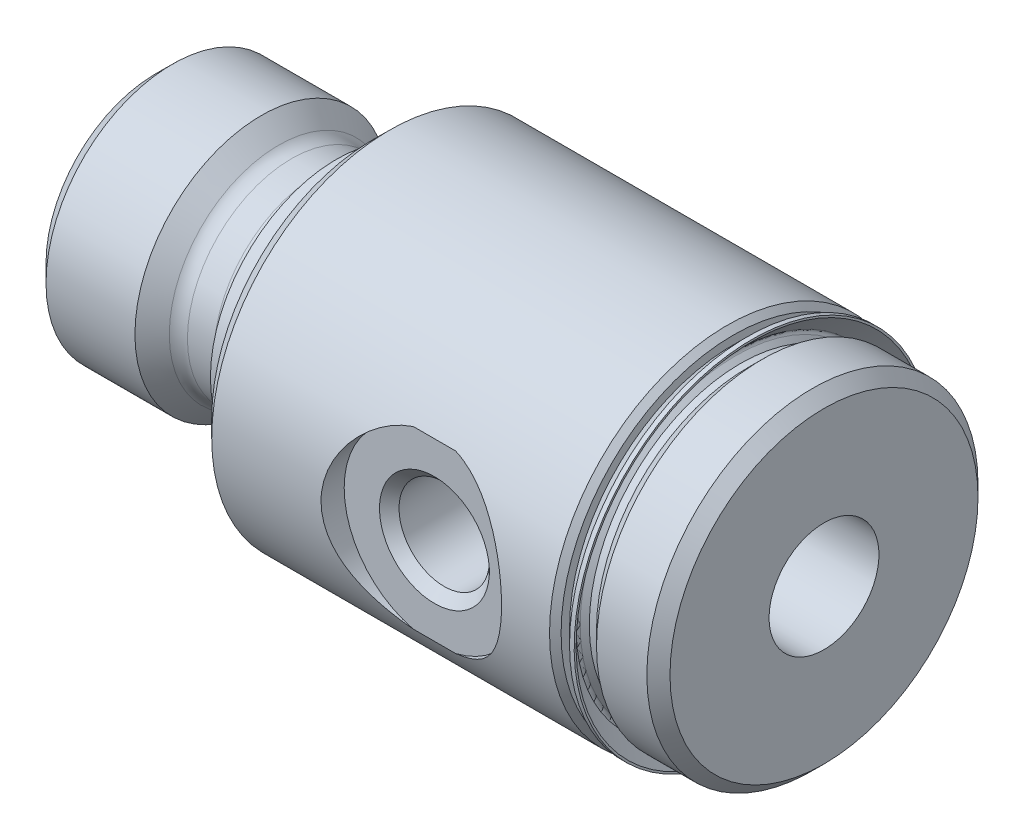
ISO-10303-21;
HEADER;
FILE_DESCRIPTION(('STEP AP214'),'2;1');
FILE_NAME('part.step','',(''),(''),'','','');
FILE_SCHEMA(('AUTOMOTIVE_DESIGN { 1 0 10303 214 1 1 1 1 }'));
ENDSEC;
DATA;
#1=APPLICATION_CONTEXT('core data for automotive mechanical design processes');
#2=APPLICATION_PROTOCOL_DEFINITION('international standard','automotive_design',2000,#1);
#3=PRODUCT_CONTEXT('',#1,'mechanical');
#4=PRODUCT('Part','Part','',(#3));
#5=PRODUCT_RELATED_PRODUCT_CATEGORY('part','',(#4));
#6=PRODUCT_DEFINITION_FORMATION('','',#4);
#7=PRODUCT_DEFINITION_CONTEXT('part definition',#1,'design');
#8=PRODUCT_DEFINITION('design','',#6,#7);
#9=PRODUCT_DEFINITION_SHAPE('','',#8);
#10=(LENGTH_UNIT() NAMED_UNIT(*) SI_UNIT(.MILLI.,.METRE.));
#11=(NAMED_UNIT(*) PLANE_ANGLE_UNIT() SI_UNIT($,.RADIAN.));
#12=(NAMED_UNIT(*) SI_UNIT($,.STERADIAN.) SOLID_ANGLE_UNIT());
#13=UNCERTAINTY_MEASURE_WITH_UNIT(LENGTH_MEASURE(1.E-05),#10,'distance_accuracy_value','');
#14=(GEOMETRIC_REPRESENTATION_CONTEXT(3) GLOBAL_UNCERTAINTY_ASSIGNED_CONTEXT((#13)) GLOBAL_UNIT_ASSIGNED_CONTEXT((#10,
#11,#12)) REPRESENTATION_CONTEXT('',''));
#15=CARTESIAN_POINT('',(0.,0.,0.));
#16=DIRECTION('',(0.,0.,1.));
#17=DIRECTION('',(1.,0.,0.));
#18=AXIS2_PLACEMENT_3D('',#15,#16,#17);
#19=CARTESIAN_POINT('',(25.3746,7.5565,0.));
#20=DIRECTION('',(-1.,0.,0.));
#21=DIRECTION('',(0.,0.,1.));
#22=AXIS2_PLACEMENT_3D('',#19,#20,#21);
#23=PLANE('',#22);
#24=CARTESIAN_POINT('',(25.3746,0.,0.));
#25=DIRECTION('',(-1.,0.,0.));
#26=DIRECTION('',(0.,0.,1.));
#27=AXIS2_PLACEMENT_3D('',#24,#25,#26);
#28=CIRCLE('',#27,7.5565);
#29=CARTESIAN_POINT('',(25.3746,0.,7.5565));
#30=VERTEX_POINT('',#29);
#31=EDGE_CURVE('E187',#30,#30,#28,.T.);
#32=ORIENTED_EDGE('',*,*,#31,.F.);
#33=EDGE_LOOP('',(#32));
#34=FACE_BOUND('',#33,.T.);
#35=CARTESIAN_POINT('',(25.3746,-4.62285431126814E-13,1.16560763103145E-13));
#36=DIRECTION('',(-1.,0.,0.));
#37=DIRECTION('',(0.,0.,1.));
#38=AXIS2_PLACEMENT_3D('',#35,#36,#37);
#39=CIRCLE('',#38,7.18614380798168);
#40=CARTESIAN_POINT('',(25.3746,-4.62285431126814E-13,7.1861438079818));
#41=VERTEX_POINT('',#40);
#42=EDGE_CURVE('E11',#41,#41,#39,.F.);
#43=ORIENTED_EDGE('',*,*,#42,.F.);
#44=EDGE_LOOP('',(#43));
#45=FACE_BOUND('',#44,.T.);
#46=ADVANCED_FACE('F38',(#34,#45),#23,.F.);
#47=CARTESIAN_POINT('',(29.3624,0.,0.));
#48=DIRECTION('',(-1.,0.,0.));
#49=DIRECTION('',(0.,0.,1.));
#50=AXIS2_PLACEMENT_3D('',#47,#48,#49);
#51=CYLINDRICAL_SURFACE('',#50,6.63575);
#52=CARTESIAN_POINT('',(26.0096,0.,0.));
#53=DIRECTION('',(-1.,0.,0.));
#54=DIRECTION('',(0.,0.,1.));
#55=AXIS2_PLACEMENT_3D('',#52,#53,#54);
#56=CIRCLE('',#55,6.63575);
#57=CARTESIAN_POINT('',(26.0096,0.,6.63575));
#58=VERTEX_POINT('',#57);
#59=EDGE_CURVE('E179',#58,#58,#56,.T.);
#60=ORIENTED_EDGE('',*,*,#59,.T.);
#61=EDGE_LOOP('',(#60));
#62=FACE_BOUND('',#61,.T.);
#63=CARTESIAN_POINT('',(25.6921000000003,-4.56834570172766E-13,0.));
#64=DIRECTION('',(-1.,0.,0.));
#65=DIRECTION('',(0.,-1.,0.));
#66=AXIS2_PLACEMENT_3D('',#63,#64,#65);
#67=CIRCLE('',#66,6.63575);
#68=CARTESIAN_POINT('',(25.6921000000002,-6.63575000000046,0.));
#69=VERTEX_POINT('',#68);
#70=EDGE_CURVE('E46',#69,#69,#67,.T.);
#71=ORIENTED_EDGE('',*,*,#70,.F.);
#72=EDGE_LOOP('',(#71));
#73=FACE_BOUND('',#72,.T.);
#74=ADVANCED_FACE('F93',(#62,#73),#51,.T.);
#75=CARTESIAN_POINT('',(29.3624,0.,0.));
#76=DIRECTION('',(-1.,0.,0.));
#77=DIRECTION('',(0.,0.,1.));
#78=AXIS2_PLACEMENT_3D('',#75,#76,#77);
#79=CYLINDRICAL_SURFACE('',#78,7.8105);
#80=CARTESIAN_POINT('',(10.287,0.,0.));
#81=DIRECTION('',(-1.,0.,0.));
#82=DIRECTION('',(0.,0.,1.));
#83=AXIS2_PLACEMENT_3D('',#80,#81,#82);
#84=CIRCLE('',#83,7.8105);
#85=CARTESIAN_POINT('',(10.287,0.,7.8105));
#86=VERTEX_POINT('',#85);
#87=EDGE_CURVE('E193',#86,#86,#84,.T.);
#88=ORIENTED_EDGE('',*,*,#87,.F.);
#89=EDGE_LOOP('',(#88));
#90=FACE_BOUND('',#89,.T.);
#91=CARTESIAN_POINT('',(25.1206,0.,0.));
#92=DIRECTION('',(-1.,0.,0.));
#93=DIRECTION('',(0.,0.,1.));
#94=AXIS2_PLACEMENT_3D('',#91,#92,#93);
#95=CIRCLE('',#94,7.8105);
#96=CARTESIAN_POINT('',(25.1206,0.,7.8105));
#97=VERTEX_POINT('',#96);
#98=EDGE_CURVE('E190',#97,#97,#95,.T.);
#99=ORIENTED_EDGE('',*,*,#98,.T.);
#100=EDGE_LOOP('',(#99));
#101=FACE_BOUND('',#100,.T.);
#102=DIRECTION('',(-1.,0.,0.));
#103=VECTOR('',#102,1.);
#104=CARTESIAN_POINT('',(29.3624,-3.85210072557819,6.7945));
#105=LINE('',#104,#103);
#106=CARTESIAN_POINT('',(18.1215961223692,-3.85210072557819,6.7945));
#107=VERTEX_POINT('',#106);
#108=CARTESIAN_POINT('',(19.9784038776308,-3.85210072557819,6.7945));
#109=VERTEX_POINT('',#108);
#110=EDGE_CURVE('E76',#107,#109,#105,.F.);
#111=ORIENTED_EDGE('',*,*,#110,.F.);
#112=CARTESIAN_POINT('',(18.1215961223692,3.85210072557819,6.7945));
#113=CARTESIAN_POINT('',(18.0128551494508,3.82589500564141,6.80934433204708));
#114=CARTESIAN_POINT('',(17.9056209649567,3.7951750058606,6.82657399668449));
#115=CARTESIAN_POINT('',(17.6948458436702,3.72511680182272,6.86506038601814));
#116=CARTESIAN_POINT('',(17.5913019230518,3.6857857528599,6.88631376526359));
#117=CARTESIAN_POINT('',(17.2878087065809,3.55577888639685,6.9548471368729));
#118=CARTESIAN_POINT('',(17.0940755421578,3.45286266206165,7.00703729481279));
#119=CARTESIAN_POINT('',(16.7281103611202,3.21817634438967,7.11786553311781));
#120=CARTESIAN_POINT('',(16.5558202225669,3.08648703832436,7.17648533571343));
#121=CARTESIAN_POINT('',(16.2347811190607,2.79677234095305,7.29427484256322));
#122=CARTESIAN_POINT('',(16.0860629837427,2.63871300579142,7.35344516154358));
#123=CARTESIAN_POINT('',(15.8070015488362,2.28841557588025,7.47015661481015));
#124=CARTESIAN_POINT('',(15.6784285339262,2.09464302317268,7.52735477020865));
#125=CARTESIAN_POINT('',(15.4562392511672,1.68511919200369,7.62946016123117));
#126=CARTESIAN_POINT('',(15.3625889509786,1.4693895732163,7.67437935130223));
#127=CARTESIAN_POINT('',(15.222598391159,1.04670163284468,7.74267421743849));
#128=CARTESIAN_POINT('',(15.1721871592955,0.841388849692413,7.76787617373968));
#129=CARTESIAN_POINT('',(15.1046975346992,0.424044677405607,7.80178403706623));
#130=CARTESIAN_POINT('',(15.0876021327686,0.212016772858688,7.81049836168719));
#131=CARTESIAN_POINT('',(15.0875979050919,-0.208253092440595,7.81050160922981));
#132=CARTESIAN_POINT('',(15.104087593126,-0.416495444900188,7.80209711836994));
#133=CARTESIAN_POINT('',(15.1692154971974,-0.826593665158206,7.76936300856744));
#134=CARTESIAN_POINT('',(15.217861199563,-1.02844803428297,7.7450296812023));
#135=CARTESIAN_POINT('',(15.3449093253086,-1.41953626393276,7.68296480855789));
#136=CARTESIAN_POINT('',(15.4232143015947,-1.60880909321737,7.645277165452));
#137=CARTESIAN_POINT('',(15.6067613235194,-1.97130408916965,7.55993347529357));
#138=CARTESIAN_POINT('',(15.7120099406,-2.14452232613126,7.51227499691478));
#139=CARTESIAN_POINT('',(15.9538052593816,-2.48190984333818,7.40790858770927));
#140=CARTESIAN_POINT('',(16.0918793620173,-2.64486639030063,7.35082425979542));
#141=CARTESIAN_POINT('',(16.3921031272662,-2.94644852490168,7.23522519139544));
#142=CARTESIAN_POINT('',(16.5542737306898,-3.08505271842146,7.17670924409722));
#143=CARTESIAN_POINT('',(16.9000859546562,-3.3352651062674,7.06390731868926));
#144=CARTESIAN_POINT('',(17.0837507646518,-3.44684373778793,7.00962601637755));
#145=CARTESIAN_POINT('',(17.3722265046765,-3.59127493866339,6.93610629540564));
#146=CARTESIAN_POINT('',(17.470460770679,-3.63556844811676,6.91293281761722));
#147=CARTESIAN_POINT('',(17.6708258445217,-3.71619801837318,6.86992504364547));
#148=CARTESIAN_POINT('',(17.7729539079885,-3.75253956633275,6.85008844708623));
#149=CARTESIAN_POINT('',(17.9170538936038,-3.79721428881743,6.82534082601764));
#150=CARTESIAN_POINT('',(17.9576644911665,-3.80909600866532,6.81871427962771));
#151=CARTESIAN_POINT('',(18.0393123286186,-3.83156813434324,6.80611204807017));
#152=CARTESIAN_POINT('',(18.0803492748927,-3.84215937221748,6.80013594379516));
#153=CARTESIAN_POINT('',(18.1215961223692,-3.85210072557819,6.7945));
#154=B_SPLINE_CURVE_WITH_KNOTS('',3,(#112,#113,#114,#115,#116,#117,#118,#119,#120,#121,#122,
#123,#124,#125,#126,#127,#128,#129,#130,#131,#132,#133,#134,#135,#136,#137,#138,#139,#140,#141,
#142,#143,#144,#145,#146,#147,#148,#149,#150,#151,#152,#153),.UNSPECIFIED.,.F.,.F.,(4,2,2,2,2,2,
2,2,2,2,2,2,2,2,2,2,2,2,2,2,4),(0.,0.338222818675507,0.676165652849871,1.34921264078912,
2.02039363276876,2.69244533968194,3.40724108890215,4.12133843480017,4.75688409927621,
5.39210520461712,6.01604998873545,6.64014008630428,7.26219724397964,7.88440626359152,
8.54490302049853,9.20597716914358,9.86777122242373,10.1981171851282,10.5282344725933,
10.6567002766157,10.7850828084273),.UNSPECIFIED.);
#155=CARTESIAN_POINT('',(18.1215961223692,3.85210072557819,6.7945));
#156=VERTEX_POINT('',#155);
#157=EDGE_CURVE('E56',#156,#107,#154,.T.);
#158=ORIENTED_EDGE('',*,*,#157,.F.);
#159=DIRECTION('',(-1.,0.,0.));
#160=VECTOR('',#159,1.);
#161=CARTESIAN_POINT('',(29.3624,3.85210072557819,6.7945));
#162=LINE('',#161,#160);
#163=CARTESIAN_POINT('',(19.9784038776308,3.85210072557819,6.7945));
#164=VERTEX_POINT('',#163);
#165=EDGE_CURVE('E72',#164,#156,#162,.T.);
#166=ORIENTED_EDGE('',*,*,#165,.F.);
#167=CARTESIAN_POINT('',(19.9784038776308,-3.85210072557819,6.7945));
#168=CARTESIAN_POINT('',(20.0871441476983,-3.82589544686893,6.80934420874089));
#169=CARTESIAN_POINT('',(20.1943778263773,-3.79517548526654,6.82657379028904));
#170=CARTESIAN_POINT('',(20.4051519641891,-3.72511745285641,6.86505997155541));
#171=CARTESIAN_POINT('',(20.5086954076075,-3.68578653845436,6.88631322530072));
#172=CARTESIAN_POINT('',(20.8121889417393,-3.55578060620909,6.95484648081365));
#173=CARTESIAN_POINT('',(21.0059222633617,-3.45286628823123,7.00703655483552));
#174=CARTESIAN_POINT('',(21.3718946574185,-3.21817091332426,7.11786712811991));
#175=CARTESIAN_POINT('',(21.5441915172288,-3.08647022469435,7.17648944675929));
#176=CARTESIAN_POINT('',(21.8652206001147,-2.79677701729547,7.29427566912561));
#177=CARTESIAN_POINT('',(22.0139229679327,-2.63875169860475,7.35344016037897));
#178=CARTESIAN_POINT('',(22.2930004460401,-2.28839067605303,7.47015651935842));
#179=CARTESIAN_POINT('',(22.4216119254221,-2.09451336659921,7.52736735939915));
#180=CARTESIAN_POINT('',(22.5882521642072,-1.78745629875585,7.60395461709459));
#181=CARTESIAN_POINT('',(22.6394307437685,-1.68236335543616,7.62795130954219));
#182=CARTESIAN_POINT('',(22.7325253651758,-1.46741590935401,7.67219678193279));
#183=CARTESIAN_POINT('',(22.7744464910334,-1.35756405994037,7.69244761802928));
#184=CARTESIAN_POINT('',(22.8463423582829,-1.14048258055079,7.72752147938978));
#185=CARTESIAN_POINT('',(22.8768734567333,-1.03347688643544,7.7425931442856));
#186=CARTESIAN_POINT('',(22.9288925199877,-0.816827347829275,7.76843568198634));
#187=CARTESIAN_POINT('',(22.9503849783784,-0.707184842968019,7.77920869174365));
#188=CARTESIAN_POINT('',(22.9840506327867,-0.486160747751197,7.79614258259886));
#189=CARTESIAN_POINT('',(22.9962268423637,-0.374779731663954,7.80230495510138));
#190=CARTESIAN_POINT('',(23.0110970240145,-0.151228170032675,7.80983636785463));
#191=CARTESIAN_POINT('',(23.0137917464325,-0.039057687669266,7.81120578740914));
#192=CARTESIAN_POINT('',(23.0098626942883,0.174230727152877,7.80921306572696));
#193=CARTESIAN_POINT('',(23.0041134263872,0.27537023055635,7.80629495337319));
#194=CARTESIAN_POINT('',(22.9849140365282,0.476760563041044,7.79658748131316));
#195=CARTESIAN_POINT('',(22.9714614433281,0.577011096453558,7.78979687930726));
#196=CARTESIAN_POINT('',(22.9370107815293,0.775843869491242,7.77251093312911));
#197=CARTESIAN_POINT('',(22.9160156536495,0.874426743647872,7.76201703284431));
#198=CARTESIAN_POINT('',(22.866711471725,1.06932194629942,7.73757915700026));
#199=CARTESIAN_POINT('',(22.8383996096475,1.16563338753835,7.72363385694216));
#200=CARTESIAN_POINT('',(22.7429622417522,1.45000298576463,7.67711751193974));
#201=CARTESIAN_POINT('',(22.6652689288464,1.63387127553527,7.63983166466624));
#202=CARTESIAN_POINT('',(22.4844105074451,1.98613907629758,7.55592978822106));
#203=CARTESIAN_POINT('',(22.3812378745803,2.15453399761334,7.50931100368502));
#204=CARTESIAN_POINT('',(22.1415879893032,2.48767198577414,7.40597608662514));
#205=CARTESIAN_POINT('',(22.0029338281294,2.65068693044984,7.34872708336746));
#206=CARTESIAN_POINT('',(21.7014854689175,2.95225332865382,7.23286067534091));
#207=CARTESIAN_POINT('',(21.5386683630018,3.09078129100682,7.17424201698428));
#208=CARTESIAN_POINT('',(21.1919493818625,3.34037993308468,7.06148087689161));
#209=CARTESIAN_POINT('',(21.0080772310669,3.45148863901216,7.00733226609807));
#210=CARTESIAN_POINT('',(20.7193479654856,3.59519821350266,6.93407158259833));
#211=CARTESIAN_POINT('',(20.6210409964459,3.63924791955856,6.91099474451808));
#212=CARTESIAN_POINT('',(20.4205507786716,3.71938598222265,6.86819783346445));
#213=CARTESIAN_POINT('',(20.3183702846579,3.75547987671839,6.84847542773293));
#214=CARTESIAN_POINT('',(20.1756487853759,3.79936734605261,6.8241412914012));
#215=CARTESIAN_POINT('',(20.1364755120194,3.81075500048536,6.81778630014991));
#216=CARTESIAN_POINT('',(20.0577343126525,3.83232947195563,6.8056824487551));
#217=CARTESIAN_POINT('',(20.0181666526235,3.84251704581509,6.79993320684443));
#218=CARTESIAN_POINT('',(19.9784038776308,3.85210072557826,6.79450000000023));
#219=B_SPLINE_CURVE_WITH_KNOTS('',3,(#167,#168,#169,#170,#171,#172,#173,#174,#175,#176,#177,
#178,#179,#180,#181,#182,#183,#184,#185,#186,#187,#188,#189,#190,#191,#192,#193,#194,#195,#196,
#197,#198,#199,#200,#201,#202,#203,#204,#205,#206,#207,#208,#209,#210,#211,#212,#213,#214,#215,
#216,#217,#218),.UNSPECIFIED.,.F.,.F.,(4,2,2,2,2,2,2,2,2,2,2,2,2,2,2,2,2,2,2,2,2,2,2,2,2,4),(0.,
0.338221009541507,0.676161989637869,1.34921263131612,2.02040766224254,2.69244533008579,
3.40716181306005,3.76473320700903,4.12210773870362,4.45852719349783,4.7947791980813,
5.13092238801829,5.46703897572,5.77070634470169,6.07447118541031,6.37811772116265,
6.68188096457571,7.28827462636846,7.89484757855807,8.55664209811417,9.21906809364815,
9.88057017933556,10.210756651782,10.5407125568174,10.664555135566,10.7883191909823),.UNSPECIFIED.);
#220=EDGE_CURVE('E64',#109,#164,#219,.T.);
#221=ORIENTED_EDGE('',*,*,#220,.F.);
#222=EDGE_LOOP('',(#111,#158,#166,#221));
#223=FACE_BOUND('',#222,.T.);
#224=ADVANCED_FACE('F79',(#90,#101,#223),#79,.T.);
#225=CARTESIAN_POINT('',(29.3624,0.,0.));
#226=DIRECTION('',(-1.,0.,0.));
#227=DIRECTION('',(0.,0.,1.));
#228=AXIS2_PLACEMENT_3D('',#225,#226,#227);
#229=CYLINDRICAL_SURFACE('',#228,2.413);
#230=CARTESIAN_POINT('',(29.3624,0.,0.));
#231=DIRECTION('',(-1.,0.,0.));
#232=DIRECTION('',(0.,0.,1.));
#233=AXIS2_PLACEMENT_3D('',#230,#231,#232);
#234=CIRCLE('',#233,2.413);
#235=CARTESIAN_POINT('',(29.3624,0.,2.413));
#236=VERTEX_POINT('',#235);
#237=EDGE_CURVE('E566',#236,#236,#234,.T.);
#238=ORIENTED_EDGE('',*,*,#237,.F.);
#239=EDGE_LOOP('',(#238));
#240=FACE_BOUND('',#239,.T.);
#241=CARTESIAN_POINT('',(0.508000000000002,0.,0.));
#242=DIRECTION('',(-1.,0.,0.));
#243=DIRECTION('',(0.,0.,1.));
#244=AXIS2_PLACEMENT_3D('',#241,#242,#243);
#245=CIRCLE('',#244,2.413);
#246=CARTESIAN_POINT('',(0.508000000000002,0.,2.413));
#247=VERTEX_POINT('',#246);
#248=EDGE_CURVE('E569',#247,#247,#245,.T.);
#249=ORIENTED_EDGE('',*,*,#248,.T.);
#250=EDGE_LOOP('',(#249));
#251=FACE_BOUND('',#250,.T.);
#252=CARTESIAN_POINT('',(21.03374,0.,2.413));
#253=CARTESIAN_POINT('',(21.0337319164341,0.0945220466073645,2.41299211856903));
#254=CARTESIAN_POINT('',(21.0269292239376,0.189147437233285,2.40739120060085));
#255=CARTESIAN_POINT('',(21.0001923929391,0.3753111322332,2.38548503970721));
#256=CARTESIAN_POINT('',(20.9802357586433,0.466843865144181,2.36916145911039));
#257=CARTESIAN_POINT('',(20.9286651778364,0.643638686775528,2.32733774653844));
#258=CARTESIAN_POINT('',(20.8971247953411,0.728936359771255,2.30189554755293));
#259=CARTESIAN_POINT('',(20.823991118228,0.892303010293011,2.24363620468909));
#260=CARTESIAN_POINT('',(20.7823964462025,0.970370995344806,2.21081805037016));
#261=CARTESIAN_POINT('',(20.6740557864053,1.14531283453237,2.12681153861027));
#262=CARTESIAN_POINT('',(20.6036519026973,1.23879348743713,2.07326959916021));
#263=CARTESIAN_POINT('',(20.4496915342449,1.41048196550803,1.96053949740092));
#264=CARTESIAN_POINT('',(20.3660977786655,1.48864506019885,1.90133552841052));
#265=CARTESIAN_POINT('',(20.1855560195607,1.63069711653558,1.78105240463844));
#266=CARTESIAN_POINT('',(20.088399202088,1.69431117584161,1.71995857911438));
#267=CARTESIAN_POINT('',(19.9335919509996,1.77704539126499,1.63288039902576));
#268=CARTESIAN_POINT('',(19.8805234469718,1.80249373555697,1.60463547220708));
#269=CARTESIAN_POINT('',(19.7711882851122,1.84895642164053,1.55086571898795));
#270=CARTESIAN_POINT('',(19.7149244313098,1.86997457702649,1.52533856252379));
#271=CARTESIAN_POINT('',(19.592571248157,1.90929753372179,1.4758928162836));
#272=CARTESIAN_POINT('',(19.5260876211354,1.92703376992685,1.45247560342757));
#273=CARTESIAN_POINT('',(19.3894905949824,1.95571394435063,1.41362735121573));
#274=CARTESIAN_POINT('',(19.3193866983944,1.96667477376334,1.39817646778004));
#275=CARTESIAN_POINT('',(19.1760129642332,1.98105328586897,1.37774131582023));
#276=CARTESIAN_POINT('',(19.1027169207774,1.98438732156138,1.37287314187836));
#277=CARTESIAN_POINT('',(18.956377269352,1.98288179829234,1.37504456584977));
#278=CARTESIAN_POINT('',(18.8833337657758,1.97803918912158,1.38208860748832));
#279=CARTESIAN_POINT('',(18.7320713375693,1.95974360718956,1.40791896838485));
#280=CARTESIAN_POINT('',(18.6541824709674,1.94539144628207,1.42792608296798));
#281=CARTESIAN_POINT('',(18.5032207032971,1.9084908802625,1.47687458559969));
#282=CARTESIAN_POINT('',(18.4301640501746,1.88591633425052,1.50584442352083));
#283=CARTESIAN_POINT('',(18.30478856196,1.83937826696517,1.56214114090541));
#284=CARTESIAN_POINT('',(18.2514511693482,1.81682066694284,1.58841973823639));
#285=CARTESIAN_POINT('',(18.1477611879925,1.76762056500372,1.64299745298748));
#286=CARTESIAN_POINT('',(18.0974102417775,1.74097584355795,1.67129766376483));
#287=CARTESIAN_POINT('',(17.9505907884788,1.65511616364806,1.75776297892959));
#288=CARTESIAN_POINT('',(17.8584088520246,1.58999588490261,1.81746671243101));
#289=CARTESIAN_POINT('',(17.6820718330815,1.44146919871992,1.9375985274472));
#290=CARTESIAN_POINT('',(17.5984178491116,1.35740854045677,1.99795134343659));
#291=CARTESIAN_POINT('',(17.4457009697707,1.17290528928987,2.11152406845161));
#292=CARTESIAN_POINT('',(17.376603360284,1.07250270704211,2.16476083434942));
#293=CARTESIAN_POINT('',(17.2723000399726,0.88502262184771,2.24651324006223));
#294=CARTESIAN_POINT('',(17.2329657335471,0.801470249055024,2.27784094331493));
#295=CARTESIAN_POINT('',(17.1657199781008,0.627225000810232,2.33183430716342));
#296=CARTESIAN_POINT('',(17.1378005901926,0.536537140494617,2.35450598715199));
#297=CARTESIAN_POINT('',(17.0949205066698,0.349494301501999,2.38946118723347));
#298=CARTESIAN_POINT('',(17.0800475738688,0.253105528920338,2.40167434050914));
#299=CARTESIAN_POINT('',(17.0647222342662,0.0584256803141166,2.41426007788975));
#300=CARTESIAN_POINT('',(17.0642631824537,-0.0398644982211887,2.41463811815538));
#301=CARTESIAN_POINT('',(17.0770559593979,-0.224418212344728,2.40413057695339));
#302=CARTESIAN_POINT('',(17.0888669166965,-0.310856895278874,2.39442867511659));
#303=CARTESIAN_POINT('',(17.1232880215982,-0.480065558441534,2.36631892096215));
#304=CARTESIAN_POINT('',(17.1459000238871,-0.562834905926944,2.34790957346336));
#305=CARTESIAN_POINT('',(17.2016317757834,-0.72553141390716,2.30293935373151));
#306=CARTESIAN_POINT('',(17.2350653303633,-0.80528222858229,2.27613593609941));
#307=CARTESIAN_POINT('',(17.3107593245615,-0.957878335156875,2.21625105015759));
#308=CARTESIAN_POINT('',(17.3530224549576,-1.03072151212022,2.18316766833567));
#309=CARTESIAN_POINT('',(17.4659591326648,-1.20024946245831,2.09635013380068));
#310=CARTESIAN_POINT('',(17.540837787416,-1.29282045036668,2.04004267093593));
#311=CARTESIAN_POINT('',(17.7040659725232,-1.46205223327761,1.92240008272489));
#312=CARTESIAN_POINT('',(17.7924653544502,-1.53865156305512,1.86104675680258));
#313=CARTESIAN_POINT('',(17.9349735140002,-1.6417815882445,1.76898443324213));
#314=CARTESIAN_POINT('',(17.9846036425766,-1.67442746044567,1.73802240384764));
#315=CARTESIAN_POINT('',(18.0871158668483,-1.73540769775946,1.6771350147861));
#316=CARTESIAN_POINT('',(18.1399994280344,-1.76374009962967,1.64721013192552));
#317=CARTESIAN_POINT('',(18.2488749923797,-1.81577758657096,1.58966014060258));
#318=CARTESIAN_POINT('',(18.3048532015648,-1.83950136619061,1.56202601320164));
#319=CARTESIAN_POINT('',(18.42018578155,-1.88210846847816,1.51041540156029));
#320=CARTESIAN_POINT('',(18.4795358990256,-1.90099773072961,1.48643444392774));
#321=CARTESIAN_POINT('',(18.6044001341805,-1.93417098885846,1.44302943174753));
#322=CARTESIAN_POINT('',(18.6700713672162,-1.94821011088565,1.42385834551449));
#323=CARTESIAN_POINT('',(18.8042987096678,-1.96963175022883,1.39408258648696));
#324=CARTESIAN_POINT('',(18.8728468727204,-1.97703148337786,1.38345576602903));
#325=CARTESIAN_POINT('',(19.0117076108353,-1.98459455364802,1.37259127183297));
#326=CARTESIAN_POINT('',(19.0820292544989,-1.98470616912906,1.37242785396223));
#327=CARTESIAN_POINT('',(19.2215460685279,-1.97754756857666,1.38271666022164));
#328=CARTESIAN_POINT('',(19.2907395179489,-1.97026698401266,1.39318379510266));
#329=CARTESIAN_POINT('',(19.4424980520981,-1.94638829516886,1.42640865349344));
#330=CARTESIAN_POINT('',(19.5242333396488,-1.92795785915136,1.45153252989753));
#331=CARTESIAN_POINT('',(19.6819665407168,-1.88218906975942,1.51040202515826));
#332=CARTESIAN_POINT('',(19.7579454251763,-1.85482263506092,1.54417474983995));
#333=CARTESIAN_POINT('',(19.887209505272,-1.79945372218492,1.60807163450478));
#334=CARTESIAN_POINT('',(19.9416827282057,-1.77305836931006,1.63723655755074));
#335=CARTESIAN_POINT('',(20.0473682137797,-1.71583602448893,1.69711374170356));
#336=CARTESIAN_POINT('',(20.0985788556704,-1.68500685435053,1.72782675849389));
#337=CARTESIAN_POINT('',(20.2475188187902,-1.58600546688503,1.82080314514998));
#338=CARTESIAN_POINT('',(20.3405270188704,-1.51133205760193,1.88388826734456));
#339=CARTESIAN_POINT('',(20.5151208587475,-1.34301732922407,2.00750921428923));
#340=CARTESIAN_POINT('',(20.5963798692619,-1.24896484345983,2.06794789959627));
#341=CARTESIAN_POINT('',(20.7418089874597,-1.04342062045597,2.17884447298024));
#342=CARTESIAN_POINT('',(20.8060293016541,-0.931981690870624,2.22933156896315));
#343=CARTESIAN_POINT('',(20.8957916889247,-0.732208620521947,2.30083097393904));
#344=CARTESIAN_POINT('',(20.9271300357916,-0.647980069261647,2.32610002720197));
#345=CARTESIAN_POINT('',(20.9783768796747,-0.474078253444622,2.36764702174729));
#346=CARTESIAN_POINT('',(20.9983116494065,-0.384418034749221,2.38394562674608));
#347=CARTESIAN_POINT('',(21.0191646294344,-0.244973059040376,2.40102883489277));
#348=CARTESIAN_POINT('',(21.0246170887032,-0.196261973967059,2.40550469638764));
#349=CARTESIAN_POINT('',(21.0319073481975,-0.0983766714115357,2.41149271584661));
#350=CARTESIAN_POINT('',(21.0337442078049,-0.0492023367547431,2.41300410258595));
#351=CARTESIAN_POINT('',(21.03374,0.,2.413));
#352=B_SPLINE_CURVE_WITH_KNOTS('',3,(#252,#253,#254,#255,#256,#257,#258,#259,#260,#261,#262,
#263,#264,#265,#266,#267,#268,#269,#270,#271,#272,#273,#274,#275,#276,#277,#278,#279,#280,#281,
#282,#283,#284,#285,#286,#287,#288,#289,#290,#291,#292,#293,#294,#295,#296,#297,#298,#299,#300,
#301,#302,#303,#304,#305,#306,#307,#308,#309,#310,#311,#312,#313,#314,#315,#316,#317,#318,#319,
#320,#321,#322,#323,#324,#325,#326,#327,#328,#329,#330,#331,#332,#333,#334,#335,#336,#337,#338,
#339,#340,#341,#342,#343,#344,#345,#346,#347,#348,#349,#350,#351),.UNSPECIFIED.,.T.,.F.,(4,2,2,
2,2,2,2,2,2,2,2,2,2,2,2,2,2,2,2,2,2,2,2,2,2,2,2,2,2,2,2,2,2,2,2,2,2,2,2,2,2,2,2,2,2,2,2,2,2,4),
(0.,0.283353299834322,0.567192450539978,0.849259364459222,1.13136494262671,1.51537236218872,
1.90048497909261,2.29236349277855,2.48799104588622,2.68344950489634,2.90082610431944,
3.11765857153193,3.33685797997354,3.55613917646066,3.79985092529845,4.04434435257938,
4.23488233670918,4.42552416205111,4.80699340157055,5.2045172715711,5.60108211541301,
5.89250256623598,6.18371999275441,6.47688172323537,6.76990829986735,7.03203170223322,
7.29420013093025,7.56477854787265,7.83543954309159,8.22849105791326,8.6230283548959,
8.82381836105275,9.02469948375265,9.22474790388544,9.42454935611713,9.63332241507781,
9.84155255102696,10.0512602759238,10.2612625503196,10.5222258442336,10.7840172357898,
10.9853368083022,11.1867556226546,11.5896982605349,12.0022839945916,12.4136401438246,
12.6926165924141,12.9709476910482,13.1184055530614,13.2659017719798),.UNSPECIFIED.);
#353=CARTESIAN_POINT('',(21.03374,0.,2.413));
#354=VERTEX_POINT('',#353);
#355=EDGE_CURVE('E123',#354,#354,#352,.T.);
#356=ORIENTED_EDGE('',*,*,#355,.T.);
#357=EDGE_LOOP('',(#356));
#358=FACE_BOUND('',#357,.T.);
#359=ADVANCED_FACE('F101',(#240,#251,#358),#229,.F.);
#360=CARTESIAN_POINT('',(0.,0.,0.));
#361=DIRECTION('',(1.,0.,0.));
#362=DIRECTION('',(0.,0.,-1.));
#363=AXIS2_PLACEMENT_3D('',#360,#361,#362);
#364=PLANE('',#363);
#365=CARTESIAN_POINT('',(0.,0.,0.));
#366=DIRECTION('',(-1.,0.,0.));
#367=DIRECTION('',(0.,0.,1.));
#368=AXIS2_PLACEMENT_3D('',#365,#366,#367);
#369=CIRCLE('',#368,4.8006);
#370=CARTESIAN_POINT('',(0.,0.,4.8006));
#371=VERTEX_POINT('',#370);
#372=EDGE_CURVE('E202',#371,#371,#369,.T.);
#373=ORIENTED_EDGE('',*,*,#372,.T.);
#374=EDGE_LOOP('',(#373));
#375=FACE_BOUND('',#374,.T.);
#376=CARTESIAN_POINT('',(0.,0.,0.));
#377=DIRECTION('',(-1.,0.,0.));
#378=DIRECTION('',(0.,0.,1.));
#379=AXIS2_PLACEMENT_3D('',#376,#377,#378);
#380=CIRCLE('',#379,2.921);
#381=CARTESIAN_POINT('',(0.,0.,2.921));
#382=VERTEX_POINT('',#381);
#383=EDGE_CURVE('E182',#382,#382,#380,.T.);
#384=ORIENTED_EDGE('',*,*,#383,.F.);
#385=EDGE_LOOP('',(#384));
#386=FACE_BOUND('',#385,.T.);
#387=ADVANCED_FACE('F151',(#375,#386),#364,.F.);
#388=CARTESIAN_POINT('',(29.3624,6.76275,0.));
#389=DIRECTION('',(-1.,0.,0.));
#390=DIRECTION('',(0.,0.,1.));
#391=AXIS2_PLACEMENT_3D('',#388,#389,#390);
#392=PLANE('',#391);
#393=CARTESIAN_POINT('',(29.3624,0.,0.));
#394=DIRECTION('',(-1.,0.,0.));
#395=DIRECTION('',(0.,0.,1.));
#396=AXIS2_PLACEMENT_3D('',#393,#394,#395);
#397=CIRCLE('',#396,6.76275);
#398=CARTESIAN_POINT('',(29.3624,0.,6.76275));
#399=VERTEX_POINT('',#398);
#400=EDGE_CURVE('E177',#399,#399,#397,.T.);
#401=ORIENTED_EDGE('',*,*,#400,.F.);
#402=EDGE_LOOP('',(#401));
#403=FACE_BOUND('',#402,.T.);
#404=ORIENTED_EDGE('',*,*,#237,.T.);
#405=EDGE_LOOP('',(#404));
#406=FACE_BOUND('',#405,.T.);
#407=ADVANCED_FACE('F157',(#403,#406),#392,.F.);
#408=CARTESIAN_POINT('',(9.525,0.,0.));
#409=DIRECTION('',(-1.,0.,0.));
#410=DIRECTION('',(0.,0.,1.));
#411=AXIS2_PLACEMENT_3D('',#408,#409,#410);
#412=CYLINDRICAL_SURFACE('',#411,5.53085);
#413=CARTESIAN_POINT('',(7.9502,0.,0.));
#414=DIRECTION('',(-1.,0.,0.));
#415=DIRECTION('',(0.,0.,1.));
#416=AXIS2_PLACEMENT_3D('',#413,#414,#415);
#417=CIRCLE('',#416,5.53085);
#418=CARTESIAN_POINT('',(7.9502,0.,5.53085));
#419=VERTEX_POINT('',#418);
#420=EDGE_CURVE('E122',#419,#419,#417,.T.);
#421=ORIENTED_EDGE('',*,*,#420,.F.);
#422=EDGE_LOOP('',(#421));
#423=FACE_BOUND('',#422,.T.);
#424=CARTESIAN_POINT('',(9.525,0.,0.));
#425=DIRECTION('',(1.,0.,0.));
#426=DIRECTION('',(0.,0.,-1.));
#427=AXIS2_PLACEMENT_3D('',#424,#425,#426);
#428=CIRCLE('',#427,5.53085);
#429=CARTESIAN_POINT('',(9.525,0.,-5.53085));
#430=VERTEX_POINT('',#429);
#431=EDGE_CURVE('E199',#430,#430,#428,.T.);
#432=ORIENTED_EDGE('',*,*,#431,.F.);
#433=EDGE_LOOP('',(#432));
#434=FACE_BOUND('',#433,.T.);
#435=ADVANCED_FACE('F40',(#423,#434),#412,.T.);
#436=CARTESIAN_POINT('',(7.9502,5.37209999999985,0.));
#437=DIRECTION('',(1.,0.,0.));
#438=DIRECTION('',(0.,0.,-1.));
#439=AXIS2_PLACEMENT_3D('',#436,#437,#438);
#440=PLANE('',#439);
#441=CARTESIAN_POINT('',(7.9502,0.,0.));
#442=DIRECTION('',(-1.,0.,0.));
#443=DIRECTION('',(0.,0.,1.));
#444=AXIS2_PLACEMENT_3D('',#441,#442,#443);
#445=CIRCLE('',#444,5.37209999999985);
#446=CARTESIAN_POINT('',(7.9502,0.,5.37209999999985));
#447=VERTEX_POINT('',#446);
#448=EDGE_CURVE('E220',#447,#447,#445,.T.);
#449=ORIENTED_EDGE('',*,*,#448,.F.);
#450=EDGE_LOOP('',(#449));
#451=FACE_BOUND('',#450,.T.);
#452=ORIENTED_EDGE('',*,*,#420,.T.);
#453=EDGE_LOOP('',(#452));
#454=FACE_BOUND('',#453,.T.);
#455=ADVANCED_FACE('F225',(#451,#454),#440,.F.);
#456=CARTESIAN_POINT('',(7.15010000000015,0.,0.));
#457=DIRECTION('',(-1.,0.,0.));
#458=DIRECTION('',(0.,0.,1.));
#459=AXIS2_PLACEMENT_3D('',#456,#457,#458);
#460=TOROIDAL_SURFACE('',#459,5.37209999999985,0.800099999999851);
#461=CARTESIAN_POINT('',(7.15010000000015,0.,0.));
#462=DIRECTION('',(-1.,0.,0.));
#463=DIRECTION('',(0.,0.,1.));
#464=AXIS2_PLACEMENT_3D('',#461,#462,#463);
#465=CIRCLE('',#464,4.572);
#466=CARTESIAN_POINT('',(7.15010000000015,0.,4.572));
#467=VERTEX_POINT('',#466);
#468=EDGE_CURVE('E217',#467,#467,#465,.T.);
#469=ORIENTED_EDGE('',*,*,#468,.F.);
#470=EDGE_LOOP('',(#469));
#471=FACE_BOUND('',#470,.T.);
#472=ORIENTED_EDGE('',*,*,#448,.T.);
#473=EDGE_LOOP('',(#472));
#474=FACE_BOUND('',#473,.T.);
#475=ADVANCED_FACE('F261',(#471,#474),#460,.F.);
#476=CARTESIAN_POINT('',(9.525,0.,0.));
#477=DIRECTION('',(-1.,0.,0.));
#478=DIRECTION('',(0.,0.,1.));
#479=AXIS2_PLACEMENT_3D('',#476,#477,#478);
#480=CYLINDRICAL_SURFACE('',#479,4.572);
#481=CARTESIAN_POINT('',(5.9817,0.,0.));
#482=DIRECTION('',(-1.,0.,0.));
#483=DIRECTION('',(0.,0.,1.));
#484=AXIS2_PLACEMENT_3D('',#481,#482,#483);
#485=CIRCLE('',#484,4.572);
#486=CARTESIAN_POINT('',(5.9817,0.,4.572));
#487=VERTEX_POINT('',#486);
#488=EDGE_CURVE('E214',#487,#487,#485,.T.);
#489=ORIENTED_EDGE('',*,*,#488,.F.);
#490=EDGE_LOOP('',(#489));
#491=FACE_BOUND('',#490,.T.);
#492=ORIENTED_EDGE('',*,*,#468,.T.);
#493=EDGE_LOOP('',(#492));
#494=FACE_BOUND('',#493,.T.);
#495=ADVANCED_FACE('F257',(#491,#494),#480,.T.);
#496=CARTESIAN_POINT('',(5.98170000000007,0.,0.));
#497=DIRECTION('',(-1.,0.,0.));
#498=DIRECTION('',(0.,0.,1.));
#499=AXIS2_PLACEMENT_3D('',#496,#497,#498);
#500=TOROIDAL_SURFACE('',#499,5.37210000000021,0.800100000000214);
#501=CARTESIAN_POINT('',(5.41810329137171,0.,0.));
#502=DIRECTION('',(-1.,0.,0.));
#503=DIRECTION('',(0.,0.,1.));
#504=AXIS2_PLACEMENT_3D('',#501,#502,#503);
#505=CIRCLE('',#504,4.80419264838059);
#506=CARTESIAN_POINT('',(5.41810329137171,0.,4.80419264838059));
#507=VERTEX_POINT('',#506);
#508=EDGE_CURVE('E211',#507,#507,#505,.T.);
#509=ORIENTED_EDGE('',*,*,#508,.F.);
#510=EDGE_LOOP('',(#509));
#511=FACE_BOUND('',#510,.T.);
#512=ORIENTED_EDGE('',*,*,#488,.T.);
#513=EDGE_LOOP('',(#512));
#514=FACE_BOUND('',#513,.T.);
#515=ADVANCED_FACE('F253',(#511,#514),#500,.F.);
#516=CARTESIAN_POINT('',(5.41810329137171,0.,0.));
#517=DIRECTION('',(-1.,0.,0.));
#518=DIRECTION('',(0.,0.,1.));
#519=AXIS2_PLACEMENT_3D('',#516,#517,#518);
#520=CONICAL_SURFACE('',#519,4.80419264838059,0.781588524273102);
#521=CARTESIAN_POINT('',(4.6602938643726,0.,0.));
#522=DIRECTION('',(-1.,0.,0.));
#523=DIRECTION('',(0.,0.,1.));
#524=AXIS2_PLACEMENT_3D('',#521,#522,#523);
#525=CIRCLE('',#524,5.55625);
#526=CARTESIAN_POINT('',(4.6602938643726,0.,5.55625));
#527=VERTEX_POINT('',#526);
#528=EDGE_CURVE('E208',#527,#527,#525,.T.);
#529=ORIENTED_EDGE('',*,*,#528,.F.);
#530=EDGE_LOOP('',(#529));
#531=FACE_BOUND('',#530,.T.);
#532=ORIENTED_EDGE('',*,*,#508,.T.);
#533=EDGE_LOOP('',(#532));
#534=FACE_BOUND('',#533,.T.);
#535=ADVANCED_FACE('F249',(#531,#534),#520,.T.);
#536=CARTESIAN_POINT('',(9.525,0.,0.));
#537=DIRECTION('',(-1.,0.,0.));
#538=DIRECTION('',(0.,0.,1.));
#539=AXIS2_PLACEMENT_3D('',#536,#537,#538);
#540=CYLINDRICAL_SURFACE('',#539,5.55625);
#541=CARTESIAN_POINT('',(0.75565,0.,0.));
#542=DIRECTION('',(-1.,0.,0.));
#543=DIRECTION('',(0.,0.,1.));
#544=AXIS2_PLACEMENT_3D('',#541,#542,#543);
#545=CIRCLE('',#544,5.55625);
#546=CARTESIAN_POINT('',(0.75565,0.,5.55625));
#547=VERTEX_POINT('',#546);
#548=EDGE_CURVE('E205',#547,#547,#545,.T.);
#549=ORIENTED_EDGE('',*,*,#548,.F.);
#550=EDGE_LOOP('',(#549));
#551=FACE_BOUND('',#550,.T.);
#552=ORIENTED_EDGE('',*,*,#528,.T.);
#553=EDGE_LOOP('',(#552));
#554=FACE_BOUND('',#553,.T.);
#555=ADVANCED_FACE('F240',(#551,#554),#540,.T.);
#556=CARTESIAN_POINT('',(0.75565,0.,0.));
#557=DIRECTION('',(1.,0.,0.));
#558=DIRECTION('',(0.,0.,-1.));
#559=AXIS2_PLACEMENT_3D('',#556,#557,#558);
#560=CONICAL_SURFACE('',#559,5.55625,0.785398163397448);
#561=ORIENTED_EDGE('',*,*,#372,.F.);
#562=EDGE_LOOP('',(#561));
#563=FACE_BOUND('',#562,.T.);
#564=ORIENTED_EDGE('',*,*,#548,.T.);
#565=EDGE_LOOP('',(#564));
#566=FACE_BOUND('',#565,.T.);
#567=ADVANCED_FACE('F233',(#563,#566),#560,.T.);
#568=CARTESIAN_POINT('',(9.525,0.,0.));
#569=DIRECTION('',(1.,0.,0.));
#570=DIRECTION('',(0.,0.,-1.));
#571=AXIS2_PLACEMENT_3D('',#568,#569,#570);
#572=PLANE('',#571);
#573=CARTESIAN_POINT('',(9.525,0.,0.));
#574=DIRECTION('',(-1.,0.,0.));
#575=DIRECTION('',(0.,0.,1.));
#576=AXIS2_PLACEMENT_3D('',#573,#574,#575);
#577=CIRCLE('',#576,7.0485);
#578=CARTESIAN_POINT('',(9.525,0.,7.0485));
#579=VERTEX_POINT('',#578);
#580=EDGE_CURVE('E196',#579,#579,#577,.T.);
#581=ORIENTED_EDGE('',*,*,#580,.T.);
#582=EDGE_LOOP('',(#581));
#583=FACE_BOUND('',#582,.T.);
#584=ORIENTED_EDGE('',*,*,#431,.T.);
#585=EDGE_LOOP('',(#584));
#586=FACE_BOUND('',#585,.T.);
#587=ADVANCED_FACE('F231',(#583,#586),#572,.F.);
#588=CARTESIAN_POINT('',(10.287,0.,0.));
#589=DIRECTION('',(1.,0.,0.));
#590=DIRECTION('',(0.,0.,-1.));
#591=AXIS2_PLACEMENT_3D('',#588,#589,#590);
#592=CONICAL_SURFACE('',#591,7.8105,0.78539816339745);
#593=ORIENTED_EDGE('',*,*,#580,.F.);
#594=EDGE_LOOP('',(#593));
#595=FACE_BOUND('',#594,.T.);
#596=ORIENTED_EDGE('',*,*,#87,.T.);
#597=EDGE_LOOP('',(#596));
#598=FACE_BOUND('',#597,.T.);
#599=ADVANCED_FACE('F112',(#595,#598),#592,.T.);
#600=CARTESIAN_POINT('',(25.3746,0.,0.));
#601=DIRECTION('',(-1.,0.,0.));
#602=DIRECTION('',(0.,0.,1.));
#603=AXIS2_PLACEMENT_3D('',#600,#601,#602);
#604=CONICAL_SURFACE('',#603,7.5565,0.785398163397448);
#605=ORIENTED_EDGE('',*,*,#98,.F.);
#606=EDGE_LOOP('',(#605));
#607=FACE_BOUND('',#606,.T.);
#608=ORIENTED_EDGE('',*,*,#31,.T.);
#609=EDGE_LOOP('',(#608));
#610=FACE_BOUND('',#609,.T.);
#611=ADVANCED_FACE('F110',(#607,#610),#604,.T.);
#612=CARTESIAN_POINT('',(26.6446,0.,0.));
#613=DIRECTION('',(1.,0.,0.));
#614=DIRECTION('',(0.,0.,-1.));
#615=AXIS2_PLACEMENT_3D('',#612,#613,#614);
#616=CONICAL_SURFACE('',#615,7.27075,0.785398163397448);
#617=ORIENTED_EDGE('',*,*,#59,.F.);
#618=EDGE_LOOP('',(#617));
#619=FACE_BOUND('',#618,.T.);
#620=CARTESIAN_POINT('',(26.6446,0.,0.));
#621=DIRECTION('',(-1.,0.,0.));
#622=DIRECTION('',(0.,0.,1.));
#623=AXIS2_PLACEMENT_3D('',#620,#621,#622);
#624=CIRCLE('',#623,7.27075);
#625=CARTESIAN_POINT('',(26.6446,0.,7.27075));
#626=VERTEX_POINT('',#625);
#627=EDGE_CURVE('E173',#626,#626,#624,.T.);
#628=ORIENTED_EDGE('',*,*,#627,.T.);
#629=EDGE_LOOP('',(#628));
#630=FACE_BOUND('',#629,.T.);
#631=ADVANCED_FACE('F107',(#619,#630),#616,.T.);
#632=CARTESIAN_POINT('',(29.3624,0.,0.));
#633=DIRECTION('',(-1.,0.,0.));
#634=DIRECTION('',(0.,0.,1.));
#635=AXIS2_PLACEMENT_3D('',#632,#633,#634);
#636=CYLINDRICAL_SURFACE('',#635,7.27075);
#637=ORIENTED_EDGE('',*,*,#627,.F.);
#638=EDGE_LOOP('',(#637));
#639=FACE_BOUND('',#638,.T.);
#640=CARTESIAN_POINT('',(28.8544,0.,0.));
#641=DIRECTION('',(-1.,0.,0.));
#642=DIRECTION('',(0.,0.,1.));
#643=AXIS2_PLACEMENT_3D('',#640,#641,#642);
#644=CIRCLE('',#643,7.27075);
#645=CARTESIAN_POINT('',(28.8544,0.,7.27075));
#646=VERTEX_POINT('',#645);
#647=EDGE_CURVE('E176',#646,#646,#644,.T.);
#648=ORIENTED_EDGE('',*,*,#647,.T.);
#649=EDGE_LOOP('',(#648));
#650=FACE_BOUND('',#649,.T.);
#651=ADVANCED_FACE('F162',(#639,#650),#636,.T.);
#652=CARTESIAN_POINT('',(29.3624,0.,0.));
#653=DIRECTION('',(-1.,0.,0.));
#654=DIRECTION('',(0.,0.,1.));
#655=AXIS2_PLACEMENT_3D('',#652,#653,#654);
#656=CONICAL_SURFACE('',#655,6.76275,0.785398163397447);
#657=ORIENTED_EDGE('',*,*,#647,.F.);
#658=EDGE_LOOP('',(#657));
#659=FACE_BOUND('',#658,.T.);
#660=ORIENTED_EDGE('',*,*,#400,.T.);
#661=EDGE_LOOP('',(#660));
#662=FACE_BOUND('',#661,.T.);
#663=ADVANCED_FACE('F155',(#659,#662),#656,.T.);
#664=CARTESIAN_POINT('',(0.508000000000002,0.,0.));
#665=DIRECTION('',(-1.,0.,0.));
#666=DIRECTION('',(0.,0.,1.));
#667=AXIS2_PLACEMENT_3D('',#664,#665,#666);
#668=CONICAL_SURFACE('',#667,2.413,0.785398163397447);
#669=ORIENTED_EDGE('',*,*,#383,.T.);
#670=EDGE_LOOP('',(#669));
#671=FACE_BOUND('',#670,.T.);
#672=ORIENTED_EDGE('',*,*,#248,.F.);
#673=EDGE_LOOP('',(#672));
#674=FACE_BOUND('',#673,.T.);
#675=ADVANCED_FACE('F139',(#671,#674),#668,.F.);
#676=CARTESIAN_POINT('',(21.463,0.,6.7945));
#677=DIRECTION('',(0.,0.,1.));
#678=DIRECTION('',(1.,0.,0.));
#679=AXIS2_PLACEMENT_3D('',#676,#677,#678);
#680=PLANE('',#679);
#681=CARTESIAN_POINT('',(19.05,0.,6.7945));
#682=DIRECTION('',(0.,0.,-1.));
#683=DIRECTION('',(-1.,0.,0.));
#684=AXIS2_PLACEMENT_3D('',#681,#682,#683);
#685=CIRCLE('',#684,2.413);
#686=CARTESIAN_POINT('',(16.637,0.,6.7945));
#687=VERTEX_POINT('',#686);
#688=EDGE_CURVE('E77',#687,#687,#685,.T.);
#689=ORIENTED_EDGE('',*,*,#688,.T.);
#690=EDGE_LOOP('',(#689));
#691=FACE_BOUND('',#690,.T.);
#692=ORIENTED_EDGE('',*,*,#165,.T.);
#693=CARTESIAN_POINT('',(19.05,0.,6.7945));
#694=DIRECTION('',(0.,0.,-1.));
#695=DIRECTION('',(-1.,0.,0.));
#696=AXIS2_PLACEMENT_3D('',#693,#694,#695);
#697=CIRCLE('',#696,3.9624);
#698=EDGE_CURVE('E52',#107,#156,#697,.T.);
#699=ORIENTED_EDGE('',*,*,#698,.F.);
#700=ORIENTED_EDGE('',*,*,#110,.T.);
#701=EDGE_CURVE('E67',#164,#109,#697,.T.);
#702=ORIENTED_EDGE('',*,*,#701,.F.);
#703=EDGE_LOOP('',(#692,#699,#700,#702));
#704=FACE_BOUND('',#703,.T.);
#705=ADVANCED_FACE('F75',(#691,#704),#680,.T.);
#706=CARTESIAN_POINT('',(19.05,0.,7.8105));
#707=DIRECTION('',(0.,0.,-1.));
#708=DIRECTION('',(-1.,0.,0.));
#709=AXIS2_PLACEMENT_3D('',#706,#707,#708);
#710=CYLINDRICAL_SURFACE('',#709,3.9624);
#711=ORIENTED_EDGE('',*,*,#701,.T.);
#712=ORIENTED_EDGE('',*,*,#220,.T.);
#713=EDGE_LOOP('',(#711,#712));
#714=FACE_BOUND('',#713,.T.);
#715=ADVANCED_FACE('F66',(#714),#710,.F.);
#716=ORIENTED_EDGE('',*,*,#157,.T.);
#717=ORIENTED_EDGE('',*,*,#698,.T.);
#718=EDGE_LOOP('',(#716,#717));
#719=FACE_BOUND('',#718,.T.);
#720=ADVANCED_FACE('F133',(#719),#710,.F.);
#721=CARTESIAN_POINT('',(19.05,0.,7.8105));
#722=DIRECTION('',(0.,0.,-1.));
#723=DIRECTION('',(-1.,0.,0.));
#724=AXIS2_PLACEMENT_3D('',#721,#722,#723);
#725=CYLINDRICAL_SURFACE('',#724,1.98374);
#726=ORIENTED_EDGE('',*,*,#355,.F.);
#727=EDGE_LOOP('',(#726));
#728=FACE_BOUND('',#727,.T.);
#729=CARTESIAN_POINT('',(19.05,0.,6.36524));
#730=DIRECTION('',(0.,0.,-1.));
#731=DIRECTION('',(-1.,0.,0.));
#732=AXIS2_PLACEMENT_3D('',#729,#730,#731);
#733=CIRCLE('',#732,1.98374);
#734=CARTESIAN_POINT('',(17.06626,0.,6.36524));
#735=VERTEX_POINT('',#734);
#736=EDGE_CURVE('E563',#735,#735,#733,.T.);
#737=ORIENTED_EDGE('',*,*,#736,.F.);
#738=EDGE_LOOP('',(#737));
#739=FACE_BOUND('',#738,.T.);
#740=ADVANCED_FACE('F143',(#728,#739),#725,.F.);
#741=CARTESIAN_POINT('',(19.05,0.,6.7945));
#742=DIRECTION('',(0.,0.,1.));
#743=DIRECTION('',(1.,0.,0.));
#744=AXIS2_PLACEMENT_3D('',#741,#742,#743);
#745=CONICAL_SURFACE('',#744,2.413,0.785398163397449);
#746=ORIENTED_EDGE('',*,*,#736,.T.);
#747=EDGE_LOOP('',(#746));
#748=FACE_BOUND('',#747,.T.);
#749=ORIENTED_EDGE('',*,*,#688,.F.);
#750=EDGE_LOOP('',(#749));
#751=FACE_BOUND('',#750,.T.);
#752=ADVANCED_FACE('F141',(#748,#751),#745,.F.);
#753=CARTESIAN_POINT('',(25.9989561920189,-4.62285431126814E-13,0.));
#754=DIRECTION('',(1.,0.,0.));
#755=DIRECTION('',(0.,1.,0.));
#756=AXIS2_PLACEMENT_3D('',#753,#754,#755);
#757=CONICAL_SURFACE('',#756,7.81050000000046,0.785398163397385);
#758=ORIENTED_EDGE('',*,*,#42,.T.);
#759=EDGE_LOOP('',(#758));
#760=FACE_BOUND('',#759,.T.);
#761=CARTESIAN_POINT('',(25.9989561920189,-4.62285431126814E-13,0.));
#762=DIRECTION('',(-1.,0.,0.));
#763=DIRECTION('',(0.,-1.,0.));
#764=AXIS2_PLACEMENT_3D('',#761,#762,#763);
#765=CIRCLE('',#764,7.81050000000046);
#766=CARTESIAN_POINT('',(25.9989561920187,-7.81050000000092,0.));
#767=VERTEX_POINT('',#766);
#768=EDGE_CURVE('E558',#767,#767,#765,.T.);
#769=ORIENTED_EDGE('',*,*,#768,.T.);
#770=EDGE_LOOP('',(#769));
#771=FACE_BOUND('',#770,.T.);
#772=ADVANCED_FACE('F134',(#760,#771),#757,.T.);
#773=CARTESIAN_POINT('',(26.0096,-4.6247450313786E-13,0.));
#774=DIRECTION('',(-1.,0.,0.));
#775=DIRECTION('',(0.,-1.,0.));
#776=AXIS2_PLACEMENT_3D('',#773,#774,#775);
#777=CYLINDRICAL_SURFACE('',#776,7.81050000000046);
#778=ORIENTED_EDGE('',*,*,#768,.F.);
#779=EDGE_LOOP('',(#778));
#780=FACE_BOUND('',#779,.T.);
#781=CARTESIAN_POINT('',(26.2021561920189,-4.65894988224478E-13,0.));
#782=DIRECTION('',(-1.,0.,0.));
#783=DIRECTION('',(0.,-1.,0.));
#784=AXIS2_PLACEMENT_3D('',#781,#782,#783);
#785=CIRCLE('',#784,7.81050000000047);
#786=CARTESIAN_POINT('',(26.2021561920187,-7.81050000000093,0.));
#787=VERTEX_POINT('',#786);
#788=EDGE_CURVE('E555',#787,#787,#785,.T.);
#789=ORIENTED_EDGE('',*,*,#788,.T.);
#790=EDGE_LOOP('',(#789));
#791=FACE_BOUND('',#790,.T.);
#792=ADVANCED_FACE('F405',(#780,#791),#777,.T.);
#793=CARTESIAN_POINT('',(26.202156192019,7.7263318041258,0.));
#794=DIRECTION('',(-1.,0.,0.));
#795=DIRECTION('',(0.,-1.,0.));
#796=AXIS2_PLACEMENT_3D('',#793,#794,#795);
#797=PLANE('',#796);
#798=ORIENTED_EDGE('',*,*,#788,.F.);
#799=EDGE_LOOP('',(#798));
#800=FACE_BOUND('',#799,.T.);
#801=CARTESIAN_POINT('',(26.2021561920189,-4.65894988224478E-13,0.));
#802=DIRECTION('',(-1.,0.,0.));
#803=DIRECTION('',(0.,-1.,0.));
#804=AXIS2_PLACEMENT_3D('',#801,#802,#803);
#805=CIRCLE('',#804,7.72633180412627);
#806=CARTESIAN_POINT('',(26.2021561920187,-7.72633180412673,0.));
#807=VERTEX_POINT('',#806);
#808=EDGE_CURVE('E550',#807,#807,#805,.T.);
#809=ORIENTED_EDGE('',*,*,#808,.T.);
#810=EDGE_LOOP('',(#809));
#811=FACE_BOUND('',#810,.T.);
#812=ADVANCED_FACE('F414',(#800,#811),#797,.F.);
#813=CARTESIAN_POINT('',(25.4916397551575,-4.53273680903219E-13,0.));
#814=DIRECTION('',(1.,0.,0.));
#815=DIRECTION('',(0.,1.,0.));
#816=AXIS2_PLACEMENT_3D('',#813,#814,#815);
#817=CONICAL_SURFACE('',#816,7.0158153672651,0.785398163397325);
#818=ORIENTED_EDGE('',*,*,#808,.F.);
#819=EDGE_LOOP('',(#818));
#820=FACE_BOUND('',#819,.T.);
#821=CARTESIAN_POINT('',(25.4916397551575,-4.53273680903219E-13,0.));
#822=DIRECTION('',(-1.,0.,0.));
#823=DIRECTION('',(0.,-1.,0.));
#824=AXIS2_PLACEMENT_3D('',#821,#822,#823);
#825=CIRCLE('',#824,7.0158153672651);
#826=CARTESIAN_POINT('',(25.4916397551574,-7.01581536726555,0.));
#827=VERTEX_POINT('',#826);
#828=EDGE_CURVE('E547',#827,#827,#825,.T.);
#829=ORIENTED_EDGE('',*,*,#828,.T.);
#830=EDGE_LOOP('',(#829));
#831=FACE_BOUND('',#830,.T.);
#832=ADVANCED_FACE('F425',(#820,#831),#817,.F.);
#833=CARTESIAN_POINT('',(25.5814423163685,-4.54497550705923E-13,0.));
#834=DIRECTION('',(-1.,0.,0.));
#835=DIRECTION('',(0.,-1.,0.));
#836=AXIS2_PLACEMENT_3D('',#833,#834,#835);
#837=TOROIDAL_SURFACE('',#836,6.9260128060539,0.127000000000569);
#838=ORIENTED_EDGE('',*,*,#828,.F.);
#839=EDGE_LOOP('',(#838));
#840=FACE_BOUND('',#839,.T.);
#841=CARTESIAN_POINT('',(25.4916397551575,-4.53273680903219E-13,0.));
#842=DIRECTION('',(-1.,0.,0.));
#843=DIRECTION('',(0.,-1.,0.));
#844=AXIS2_PLACEMENT_3D('',#841,#842,#843);
#845=CIRCLE('',#844,6.83621024484286);
#846=CARTESIAN_POINT('',(25.4916397551574,-6.83621024484331,0.));
#847=VERTEX_POINT('',#846);
#848=EDGE_CURVE('E545',#847,#847,#845,.T.);
#849=ORIENTED_EDGE('',*,*,#848,.T.);
#850=EDGE_LOOP('',(#849));
#851=FACE_BOUND('',#850,.T.);
#852=ADVANCED_FACE('F436',(#840,#851),#837,.F.);
#853=CARTESIAN_POINT('',(25.6920999999999,-4.56834570172758E-13,0.));
#854=DIRECTION('',(-1.,0.,0.));
#855=DIRECTION('',(0.,-1.,0.));
#856=AXIS2_PLACEMENT_3D('',#853,#854,#855);
#857=CONICAL_SURFACE('',#856,6.63575000000046,0.785398163397435);
#858=ORIENTED_EDGE('',*,*,#848,.F.);
#859=EDGE_LOOP('',(#858));
#860=FACE_BOUND('',#859,.T.);
#861=ORIENTED_EDGE('',*,*,#70,.T.);
#862=EDGE_LOOP('',(#861));
#863=FACE_BOUND('',#862,.T.);
#864=ADVANCED_FACE('F91',(#860,#863),#857,.T.);
#865=CLOSED_SHELL('',(#46,#74,#224,#359,#387,#407,#435,#455,#475,#495,#515,#535,#555,#567,#587,
#599,#611,#631,#651,#663,#675,#705,#715,#720,#740,#752,#772,#792,#812,#832,#852,#864));
#866=MANIFOLD_SOLID_BREP('B2',#865);
#867=ADVANCED_BREP_SHAPE_REPRESENTATION('',(#18,#866),#14);
#868=SHAPE_DEFINITION_REPRESENTATION(#9,#867);
ENDSEC;
END-ISO-10303-21;
